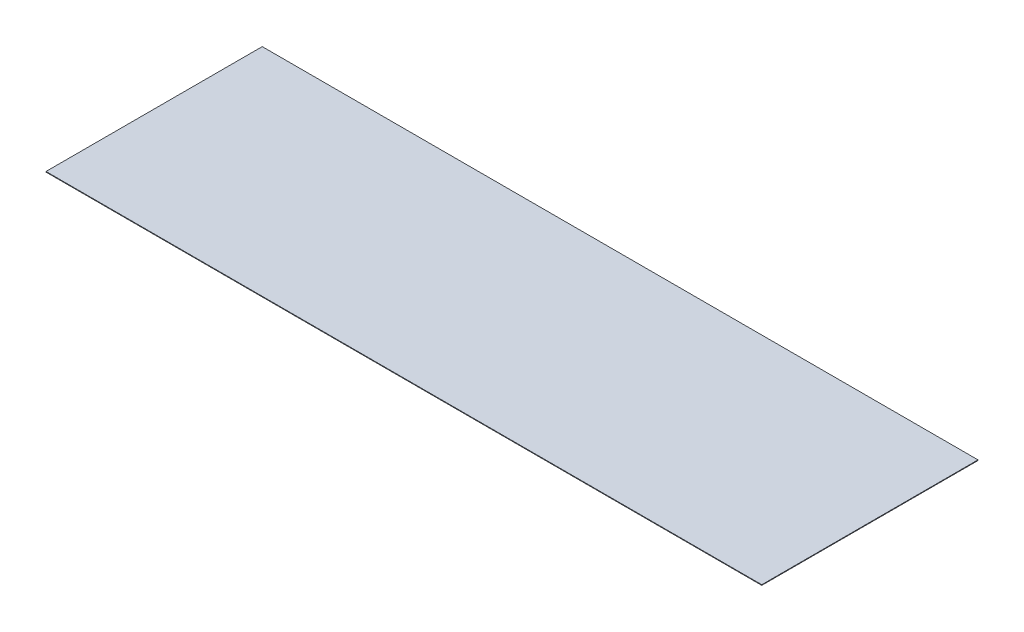
ISO-10303-21;
HEADER;
FILE_DESCRIPTION(('STEP AP214'),'2;1');
FILE_NAME('part.step','',(''),(''),'','','');
FILE_SCHEMA(('AUTOMOTIVE_DESIGN { 1 0 10303 214 1 1 1 1 }'));
ENDSEC;
DATA;
#1=APPLICATION_CONTEXT('core data for automotive mechanical design processes');
#2=APPLICATION_PROTOCOL_DEFINITION('international standard','automotive_design',2000,#1);
#3=PRODUCT_CONTEXT('',#1,'mechanical');
#4=PRODUCT('Part','Part','',(#3));
#5=PRODUCT_RELATED_PRODUCT_CATEGORY('part','',(#4));
#6=PRODUCT_DEFINITION_FORMATION('','',#4);
#7=PRODUCT_DEFINITION_CONTEXT('part definition',#1,'design');
#8=PRODUCT_DEFINITION('design','',#6,#7);
#9=PRODUCT_DEFINITION_SHAPE('','',#8);
#10=(LENGTH_UNIT() NAMED_UNIT(*) SI_UNIT(.MILLI.,.METRE.));
#11=(NAMED_UNIT(*) PLANE_ANGLE_UNIT() SI_UNIT($,.RADIAN.));
#12=(NAMED_UNIT(*) SI_UNIT($,.STERADIAN.) SOLID_ANGLE_UNIT());
#13=UNCERTAINTY_MEASURE_WITH_UNIT(LENGTH_MEASURE(1.E-05),#10,'distance_accuracy_value','');
#14=(GEOMETRIC_REPRESENTATION_CONTEXT(3) GLOBAL_UNCERTAINTY_ASSIGNED_CONTEXT((#13)) GLOBAL_UNIT_ASSIGNED_CONTEXT((#10,
#11,#12)) REPRESENTATION_CONTEXT('',''));
#15=CARTESIAN_POINT('',(0.,0.,0.));
#16=DIRECTION('',(0.,0.,1.));
#17=DIRECTION('',(1.,0.,0.));
#18=AXIS2_PLACEMENT_3D('',#15,#16,#17);
#19=CARTESIAN_POINT('',(15240.,25.4,4603.75));
#20=DIRECTION('',(-1.,0.,0.));
#21=DIRECTION('',(0.,0.,1.));
#22=AXIS2_PLACEMENT_3D('',#19,#20,#21);
#23=PLANE('',#22);
#24=DIRECTION('',(0.,0.,-1.));
#25=VECTOR('',#24,1.);
#26=CARTESIAN_POINT('',(15240.,0.,4603.75));
#27=LINE('',#26,#25);
#28=CARTESIAN_POINT('',(15240.,0.,4603.75));
#29=VERTEX_POINT('',#28);
#30=CARTESIAN_POINT('',(15240.,0.,-4603.75));
#31=VERTEX_POINT('',#30);
#32=EDGE_CURVE('E107',#29,#31,#27,.T.);
#33=ORIENTED_EDGE('',*,*,#32,.T.);
#34=DIRECTION('',(0.,-1.,0.));
#35=VECTOR('',#34,1.);
#36=CARTESIAN_POINT('',(15240.,25.4,-4603.75));
#37=LINE('',#36,#35);
#38=CARTESIAN_POINT('',(15240.,25.4,-4603.75));
#39=VERTEX_POINT('',#38);
#40=EDGE_CURVE('E11',#39,#31,#37,.T.);
#41=ORIENTED_EDGE('',*,*,#40,.F.);
#42=DIRECTION('',(0.,0.,-1.));
#43=VECTOR('',#42,1.);
#44=CARTESIAN_POINT('',(15240.,25.4,4603.75));
#45=LINE('',#44,#43);
#46=CARTESIAN_POINT('',(15240.,25.4,4603.75));
#47=VERTEX_POINT('',#46);
#48=EDGE_CURVE('E91',#47,#39,#45,.T.);
#49=ORIENTED_EDGE('',*,*,#48,.F.);
#50=DIRECTION('',(0.,-1.,0.));
#51=VECTOR('',#50,1.);
#52=CARTESIAN_POINT('',(15240.,25.4,4603.75));
#53=LINE('',#52,#51);
#54=EDGE_CURVE('E103',#47,#29,#53,.T.);
#55=ORIENTED_EDGE('',*,*,#54,.T.);
#56=EDGE_LOOP('',(#33,#41,#49,#55));
#57=FACE_BOUND('',#56,.T.);
#58=ADVANCED_FACE('F39',(#57),#23,.F.);
#59=CARTESIAN_POINT('',(-15240.,25.4,-4603.75));
#60=DIRECTION('',(0.,0.,1.));
#61=DIRECTION('',(1.,0.,0.));
#62=AXIS2_PLACEMENT_3D('',#59,#60,#61);
#63=PLANE('',#62);
#64=DIRECTION('',(-1.,0.,0.));
#65=VECTOR('',#64,1.);
#66=CARTESIAN_POINT('',(-15240.,0.,-4603.75));
#67=LINE('',#66,#65);
#68=CARTESIAN_POINT('',(-15240.,0.,-4603.75));
#69=VERTEX_POINT('',#68);
#70=EDGE_CURVE('E96',#31,#69,#67,.T.);
#71=ORIENTED_EDGE('',*,*,#70,.T.);
#72=DIRECTION('',(0.,-1.,0.));
#73=VECTOR('',#72,1.);
#74=CARTESIAN_POINT('',(-15240.,25.4,-4603.75));
#75=LINE('',#74,#73);
#76=CARTESIAN_POINT('',(-15240.,25.4,-4603.75));
#77=VERTEX_POINT('',#76);
#78=EDGE_CURVE('E48',#77,#69,#75,.T.);
#79=ORIENTED_EDGE('',*,*,#78,.F.);
#80=DIRECTION('',(-1.,0.,0.));
#81=VECTOR('',#80,1.);
#82=CARTESIAN_POINT('',(-15240.,25.4,-4603.75));
#83=LINE('',#82,#81);
#84=EDGE_CURVE('E86',#39,#77,#83,.T.);
#85=ORIENTED_EDGE('',*,*,#84,.F.);
#86=ORIENTED_EDGE('',*,*,#40,.T.);
#87=EDGE_LOOP('',(#71,#79,#85,#86));
#88=FACE_BOUND('',#87,.T.);
#89=ADVANCED_FACE('F95',(#88),#63,.F.);
#90=CARTESIAN_POINT('',(-15240.,25.4,4603.75));
#91=DIRECTION('',(1.,0.,0.));
#92=DIRECTION('',(0.,0.,-1.));
#93=AXIS2_PLACEMENT_3D('',#90,#91,#92);
#94=PLANE('',#93);
#95=DIRECTION('',(0.,0.,1.));
#96=VECTOR('',#95,1.);
#97=CARTESIAN_POINT('',(-15240.,0.,4603.75));
#98=LINE('',#97,#96);
#99=CARTESIAN_POINT('',(-15240.,0.,4603.75));
#100=VERTEX_POINT('',#99);
#101=EDGE_CURVE('E73',#69,#100,#98,.T.);
#102=ORIENTED_EDGE('',*,*,#101,.T.);
#103=DIRECTION('',(0.,-1.,0.));
#104=VECTOR('',#103,1.);
#105=CARTESIAN_POINT('',(-15240.,25.4,4603.75));
#106=LINE('',#105,#104);
#107=CARTESIAN_POINT('',(-15240.,25.4,4603.75));
#108=VERTEX_POINT('',#107);
#109=EDGE_CURVE('E98',#108,#100,#106,.T.);
#110=ORIENTED_EDGE('',*,*,#109,.F.);
#111=DIRECTION('',(0.,0.,1.));
#112=VECTOR('',#111,1.);
#113=CARTESIAN_POINT('',(-15240.,25.4,4603.75));
#114=LINE('',#113,#112);
#115=EDGE_CURVE('E89',#77,#108,#114,.T.);
#116=ORIENTED_EDGE('',*,*,#115,.F.);
#117=ORIENTED_EDGE('',*,*,#78,.T.);
#118=EDGE_LOOP('',(#102,#110,#116,#117));
#119=FACE_BOUND('',#118,.T.);
#120=ADVANCED_FACE('F99',(#119),#94,.F.);
#121=CARTESIAN_POINT('',(-15240.,25.4,4603.75));
#122=DIRECTION('',(0.,0.,-1.));
#123=DIRECTION('',(-1.,0.,0.));
#124=AXIS2_PLACEMENT_3D('',#121,#122,#123);
#125=PLANE('',#124);
#126=DIRECTION('',(1.,0.,0.));
#127=VECTOR('',#126,1.);
#128=CARTESIAN_POINT('',(-15240.,0.,4603.75));
#129=LINE('',#128,#127);
#130=EDGE_CURVE('E79',#100,#29,#129,.T.);
#131=ORIENTED_EDGE('',*,*,#130,.T.);
#132=ORIENTED_EDGE('',*,*,#54,.F.);
#133=DIRECTION('',(1.,0.,0.));
#134=VECTOR('',#133,1.);
#135=CARTESIAN_POINT('',(-15240.,25.4,4603.75));
#136=LINE('',#135,#134);
#137=EDGE_CURVE('E56',#108,#47,#136,.T.);
#138=ORIENTED_EDGE('',*,*,#137,.F.);
#139=ORIENTED_EDGE('',*,*,#109,.T.);
#140=EDGE_LOOP('',(#131,#132,#138,#139));
#141=FACE_BOUND('',#140,.T.);
#142=ADVANCED_FACE('F120',(#141),#125,.F.);
#143=CARTESIAN_POINT('',(0.,25.4,0.));
#144=DIRECTION('',(0.,-1.,0.));
#145=DIRECTION('',(0.,0.,-1.));
#146=AXIS2_PLACEMENT_3D('',#143,#144,#145);
#147=PLANE('',#146);
#148=ORIENTED_EDGE('',*,*,#48,.T.);
#149=ORIENTED_EDGE('',*,*,#84,.T.);
#150=ORIENTED_EDGE('',*,*,#115,.T.);
#151=ORIENTED_EDGE('',*,*,#137,.T.);
#152=EDGE_LOOP('',(#148,#149,#150,#151));
#153=FACE_BOUND('',#152,.T.);
#154=ADVANCED_FACE('F87',(#153),#147,.F.);
#155=CARTESIAN_POINT('',(0.,0.,0.));
#156=DIRECTION('',(0.,-1.,0.));
#157=DIRECTION('',(0.,0.,-1.));
#158=AXIS2_PLACEMENT_3D('',#155,#156,#157);
#159=PLANE('',#158);
#160=ORIENTED_EDGE('',*,*,#32,.F.);
#161=ORIENTED_EDGE('',*,*,#130,.F.);
#162=ORIENTED_EDGE('',*,*,#101,.F.);
#163=ORIENTED_EDGE('',*,*,#70,.F.);
#164=EDGE_LOOP('',(#160,#161,#162,#163));
#165=FACE_BOUND('',#164,.T.);
#166=ADVANCED_FACE('F123',(#165),#159,.T.);
#167=CLOSED_SHELL('',(#58,#89,#120,#142,#154,#166));
#168=MANIFOLD_SOLID_BREP('B2',#167);
#169=ADVANCED_BREP_SHAPE_REPRESENTATION('',(#18,#168),#14);
#170=SHAPE_DEFINITION_REPRESENTATION(#9,#169);
ENDSEC;
END-ISO-10303-21;
